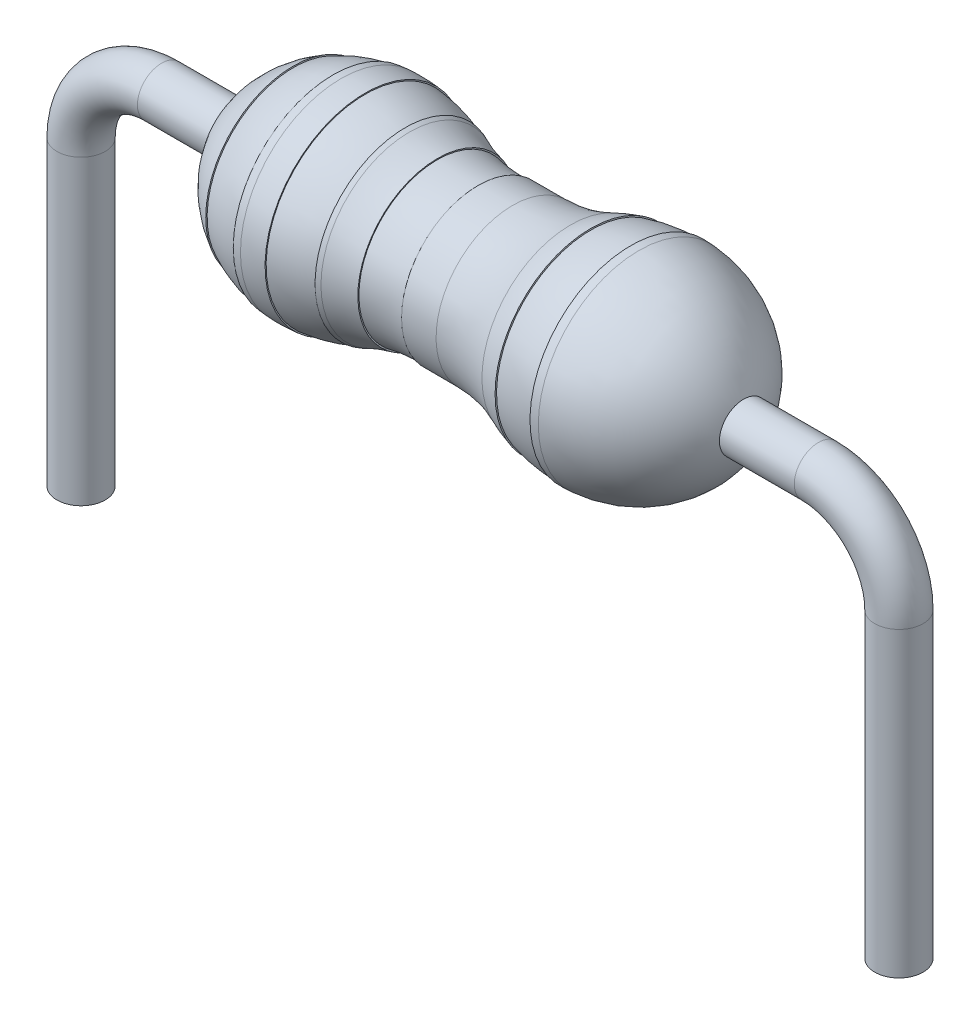
ISO-10303-21;
HEADER;
FILE_DESCRIPTION(('STEP AP214'),'2;1');
FILE_NAME('part.step','',(''),(''),'','','');
FILE_SCHEMA(('AUTOMOTIVE_DESIGN { 1 0 10303 214 1 1 1 1 }'));
ENDSEC;
DATA;
#1=APPLICATION_CONTEXT('core data for automotive mechanical design processes');
#2=APPLICATION_PROTOCOL_DEFINITION('international standard','automotive_design',2000,#1);
#3=PRODUCT_CONTEXT('',#1,'mechanical');
#4=PRODUCT('Part','Part','',(#3));
#5=PRODUCT_RELATED_PRODUCT_CATEGORY('part','',(#4));
#6=PRODUCT_DEFINITION_FORMATION('','',#4);
#7=PRODUCT_DEFINITION_CONTEXT('part definition',#1,'design');
#8=PRODUCT_DEFINITION('design','',#6,#7);
#9=PRODUCT_DEFINITION_SHAPE('','',#8);
#10=(LENGTH_UNIT() NAMED_UNIT(*) SI_UNIT(.MILLI.,.METRE.));
#11=(NAMED_UNIT(*) PLANE_ANGLE_UNIT() SI_UNIT($,.RADIAN.));
#12=(NAMED_UNIT(*) SI_UNIT($,.STERADIAN.) SOLID_ANGLE_UNIT());
#13=UNCERTAINTY_MEASURE_WITH_UNIT(LENGTH_MEASURE(1.E-05),#10,'distance_accuracy_value','');
#14=(GEOMETRIC_REPRESENTATION_CONTEXT(3) GLOBAL_UNCERTAINTY_ASSIGNED_CONTEXT((#13)) GLOBAL_UNIT_ASSIGNED_CONTEXT((#10,
#11,#12)) REPRESENTATION_CONTEXT('',''));
#15=CARTESIAN_POINT('',(0.,0.,0.));
#16=DIRECTION('',(0.,0.,1.));
#17=DIRECTION('',(1.,0.,0.));
#18=AXIS2_PLACEMENT_3D('',#15,#16,#17);
#19=CARTESIAN_POINT('',(4.88671199011125,0.,0.));
#20=DIRECTION('',(-1.,0.,0.));
#21=DIRECTION('',(0.,1.,0.));
#22=AXIS2_PLACEMENT_3D('',#19,#20,#21);
#23=DEGENERATE_TOROIDAL_SURFACE('',#22,0.59136794396373,1.84484960857024,.F.);
#24=CARTESIAN_POINT('',(5.,0.,0.));
#25=DIRECTION('',(1.,0.,0.));
#26=DIRECTION('',(0.,1.,0.));
#27=AXIS2_PLACEMENT_3D('',#24,#25,#26);
#28=CIRCLE('',#27,1.25);
#29=CARTESIAN_POINT('',(5.,1.25,0.));
#30=VERTEX_POINT('',#29);
#31=EDGE_CURVE('E94',#30,#30,#28,.T.);
#32=ORIENTED_EDGE('',*,*,#31,.F.);
#33=EDGE_LOOP('',(#32));
#34=FACE_BOUND('',#33,.T.);
#35=CARTESIAN_POINT('',(4.89996300624203,0.,0.));
#36=DIRECTION('',(-1.,0.,0.));
#37=DIRECTION('',(0.,-1.,0.));
#38=AXIS2_PLACEMENT_3D('',#35,#36,#37);
#39=CIRCLE('',#38,1.2534340749026);
#40=CARTESIAN_POINT('',(4.89996300624203,-1.2534340749026,0.));
#41=VERTEX_POINT('',#40);
#42=EDGE_CURVE('E123',#41,#41,#39,.F.);
#43=ORIENTED_EDGE('',*,*,#42,.T.);
#44=EDGE_LOOP('',(#43));
#45=FACE_BOUND('',#44,.T.);
#46=ADVANCED_FACE('F52',(#34,#45),#23,.F.);
#47=CARTESIAN_POINT('',(4.90833503188563,0.,0.));
#48=DIRECTION('',(-1.,0.,0.));
#49=DIRECTION('',(0.,1.,0.));
#50=AXIS2_PLACEMENT_3D('',#47,#48,#49);
#51=DEGENERATE_TOROIDAL_SURFACE('',#50,0.239909956367037,1.49272708304667,.F.);
#52=CARTESIAN_POINT('',(6.3,0.,0.));
#53=DIRECTION('',(1.,0.,0.));
#54=DIRECTION('',(0.,1.,0.));
#55=AXIS2_PLACEMENT_3D('',#52,#53,#54);
#56=CIRCLE('',#55,0.3);
#57=CARTESIAN_POINT('',(6.3,0.3,0.));
#58=VERTEX_POINT('',#57);
#59=EDGE_CURVE('E99',#58,#58,#56,.T.);
#60=ORIENTED_EDGE('',*,*,#59,.F.);
#61=EDGE_LOOP('',(#60));
#62=FACE_BOUND('',#61,.T.);
#63=ORIENTED_EDGE('',*,*,#31,.T.);
#64=EDGE_LOOP('',(#63));
#65=FACE_BOUND('',#64,.T.);
#66=ADVANCED_FACE('F202',(#62,#65),#51,.F.);
#67=CARTESIAN_POINT('',(8.23,-4.75,0.));
#68=DIRECTION('',(0.,1.,0.));
#69=DIRECTION('',(1.,0.,0.));
#70=AXIS2_PLACEMENT_3D('',#67,#68,#69);
#71=PLANE('',#70);
#72=CARTESIAN_POINT('',(8.23,-4.75,0.));
#73=DIRECTION('',(0.,-1.,0.));
#74=DIRECTION('',(1.,0.,0.));
#75=AXIS2_PLACEMENT_3D('',#72,#73,#74);
#76=CIRCLE('',#75,0.3);
#77=CARTESIAN_POINT('',(8.53,-4.75,0.));
#78=VERTEX_POINT('',#77);
#79=EDGE_CURVE('E72',#78,#78,#76,.T.);
#80=ORIENTED_EDGE('',*,*,#79,.T.);
#81=EDGE_LOOP('',(#80));
#82=FACE_BOUND('',#81,.T.);
#83=ADVANCED_FACE('F73',(#82),#71,.F.);
#84=CARTESIAN_POINT('',(6.3,0.,0.));
#85=DIRECTION('',(1.,0.,0.));
#86=DIRECTION('',(0.,-1.,0.));
#87=AXIS2_PLACEMENT_3D('',#84,#85,#86);
#88=CYLINDRICAL_SURFACE('',#87,0.3);
#89=CARTESIAN_POINT('',(7.23,0.,0.));
#90=DIRECTION('',(1.,0.,0.));
#91=DIRECTION('',(0.,1.,0.));
#92=AXIS2_PLACEMENT_3D('',#89,#90,#91);
#93=CIRCLE('',#92,0.3);
#94=CARTESIAN_POINT('',(7.23,0.3,0.));
#95=VERTEX_POINT('',#94);
#96=EDGE_CURVE('E87',#95,#95,#93,.T.);
#97=ORIENTED_EDGE('',*,*,#96,.F.);
#98=EDGE_LOOP('',(#97));
#99=FACE_BOUND('',#98,.T.);
#100=ORIENTED_EDGE('',*,*,#59,.T.);
#101=EDGE_LOOP('',(#100));
#102=FACE_BOUND('',#101,.T.);
#103=ADVANCED_FACE('F196',(#99,#102),#88,.T.);
#104=CARTESIAN_POINT('',(7.23,-1.,0.));
#105=DIRECTION('',(0.,0.,1.));
#106=DIRECTION('',(-1.,0.,0.));
#107=AXIS2_PLACEMENT_3D('',#104,#105,#106);
#108=TOROIDAL_SURFACE('',#107,1.,0.3);
#109=CARTESIAN_POINT('',(8.23,-1.,0.));
#110=DIRECTION('',(0.,-1.,0.));
#111=DIRECTION('',(1.,0.,0.));
#112=AXIS2_PLACEMENT_3D('',#109,#110,#111);
#113=CIRCLE('',#112,0.3);
#114=CARTESIAN_POINT('',(8.53,-1.,0.));
#115=VERTEX_POINT('',#114);
#116=EDGE_CURVE('E77',#115,#115,#113,.T.);
#117=CARTESIAN_POINT('',(7.23,-1.,0.));
#118=DIRECTION('',(0.,0.,1.));
#119=DIRECTION('',(-1.,0.,0.));
#120=AXIS2_PLACEMENT_3D('',#117,#118,#119);
#121=CIRCLE('',#120,1.3);
#122=EDGE_CURVE('',#115,#95,#121,.T.);
#123=ORIENTED_EDGE('',*,*,#116,.F.);
#124=ORIENTED_EDGE('',*,*,#96,.T.);
#125=ORIENTED_EDGE('',*,*,#122,.T.);
#126=ORIENTED_EDGE('',*,*,#122,.F.);
#127=EDGE_LOOP('',(#123,#125,#124,#126));
#128=FACE_BOUND('',#127,.T.);
#129=ADVANCED_FACE('F194',(#128),#108,.T.);
#130=CARTESIAN_POINT('',(8.23,-1.,0.));
#131=DIRECTION('',(0.,-1.,0.));
#132=DIRECTION('',(-1.,0.,0.));
#133=AXIS2_PLACEMENT_3D('',#130,#131,#132);
#134=CYLINDRICAL_SURFACE('',#133,0.3);
#135=ORIENTED_EDGE('',*,*,#79,.F.);
#136=EDGE_LOOP('',(#135));
#137=FACE_BOUND('',#136,.T.);
#138=ORIENTED_EDGE('',*,*,#116,.T.);
#139=EDGE_LOOP('',(#138));
#140=FACE_BOUND('',#139,.T.);
#141=ADVANCED_FACE('F218',(#137,#140),#134,.T.);
#142=CARTESIAN_POINT('',(4.89985634583904,0.,0.));
#143=DIRECTION('',(1.,0.,0.));
#144=DIRECTION('',(0.,1.,0.));
#145=AXIS2_PLACEMENT_3D('',#142,#143,#144);
#146=CONICAL_SURFACE('',#145,1.23858484939256,1.56361355698464);
#147=ORIENTED_EDGE('',*,*,#42,.F.);
#148=EDGE_LOOP('',(#147));
#149=FACE_BOUND('',#148,.T.);
#150=CARTESIAN_POINT('',(4.89985634583904,0.,0.));
#151=DIRECTION('',(-1.,0.,0.));
#152=DIRECTION('',(0.,-1.,0.));
#153=AXIS2_PLACEMENT_3D('',#150,#151,#152);
#154=CIRCLE('',#153,1.23858484939256);
#155=CARTESIAN_POINT('',(4.89985634583904,-1.23858484939256,0.));
#156=VERTEX_POINT('',#155);
#157=EDGE_CURVE('E181',#156,#156,#154,.T.);
#158=ORIENTED_EDGE('',*,*,#157,.F.);
#159=EDGE_LOOP('',(#158));
#160=FACE_BOUND('',#159,.T.);
#161=ADVANCED_FACE('F214',(#149,#160),#146,.T.);
#162=CARTESIAN_POINT('',(4.88671199011125,0.,0.));
#163=DIRECTION('',(-1.,0.,0.));
#164=DIRECTION('',(0.,-1.,0.));
#165=AXIS2_PLACEMENT_3D('',#162,#163,#164);
#166=DEGENERATE_TOROIDAL_SURFACE('',#165,0.59136794396373,1.83,.F.);
#167=ORIENTED_EDGE('',*,*,#157,.T.);
#168=EDGE_LOOP('',(#167));
#169=FACE_BOUND('',#168,.T.);
#170=CARTESIAN_POINT('',(4.40526175124444,0.,0.));
#171=DIRECTION('',(-1.,0.,0.));
#172=DIRECTION('',(0.,-1.,0.));
#173=AXIS2_PLACEMENT_3D('',#170,#171,#172);
#174=CIRCLE('',#173,1.17416474264819);
#175=CARTESIAN_POINT('',(4.40526175124444,-1.17416474264819,0.));
#176=VERTEX_POINT('',#175);
#177=EDGE_CURVE('E185',#176,#176,#174,.T.);
#178=ORIENTED_EDGE('',*,*,#177,.F.);
#179=EDGE_LOOP('',(#178));
#180=FACE_BOUND('',#179,.T.);
#181=ADVANCED_FACE('F217',(#169,#180),#166,.F.);
#182=CARTESIAN_POINT('',(4.4,0.,0.));
#183=DIRECTION('',(-1.,0.,0.));
#184=DIRECTION('',(0.,-1.,0.));
#185=AXIS2_PLACEMENT_3D('',#182,#183,#184);
#186=CONICAL_SURFACE('',#185,1.19346018184613,1.30457521106342);
#187=CARTESIAN_POINT('',(4.40135500392574,0.,0.));
#188=DIRECTION('',(1.,0.,0.));
#189=DIRECTION('',(0.,1.,0.));
#190=AXIS2_PLACEMENT_3D('',#187,#188,#189);
#191=CIRCLE('',#190,1.18849122861221);
#192=CARTESIAN_POINT('',(4.40135500392574,1.18849122861221,0.));
#193=VERTEX_POINT('',#192);
#194=EDGE_CURVE('E119',#193,#193,#191,.F.);
#195=ORIENTED_EDGE('',*,*,#194,.F.);
#196=EDGE_LOOP('',(#195));
#197=FACE_BOUND('',#196,.T.);
#198=ORIENTED_EDGE('',*,*,#177,.T.);
#199=EDGE_LOOP('',(#198));
#200=FACE_BOUND('',#199,.T.);
#201=ADVANCED_FACE('F224',(#197,#200),#186,.T.);
#202=CARTESIAN_POINT('',(3.15,0.,0.));
#203=DIRECTION('',(1.,0.,0.));
#204=DIRECTION('',(0.,1.,0.));
#205=AXIS2_PLACEMENT_3D('',#202,#203,#204);
#206=CYLINDRICAL_SURFACE('',#205,0.95);
#207=CARTESIAN_POINT('',(3.43,0.,0.));
#208=DIRECTION('',(1.,0.,0.));
#209=DIRECTION('',(0.,1.,0.));
#210=AXIS2_PLACEMENT_3D('',#207,#208,#209);
#211=CIRCLE('',#210,0.95);
#212=CARTESIAN_POINT('',(3.43,0.95,0.));
#213=VERTEX_POINT('',#212);
#214=EDGE_CURVE('E76',#213,#213,#211,.T.);
#215=ORIENTED_EDGE('',*,*,#214,.F.);
#216=EDGE_LOOP('',(#215));
#217=FACE_BOUND('',#216,.T.);
#218=CARTESIAN_POINT('',(3.00129083809589,0.,0.));
#219=DIRECTION('',(-1.,0.,0.));
#220=DIRECTION('',(0.,-1.,0.));
#221=AXIS2_PLACEMENT_3D('',#218,#219,#220);
#222=CIRCLE('',#221,0.95);
#223=CARTESIAN_POINT('',(3.00129083809589,-0.95,0.));
#224=VERTEX_POINT('',#223);
#225=EDGE_CURVE('E128',#224,#224,#222,.F.);
#226=ORIENTED_EDGE('',*,*,#225,.T.);
#227=EDGE_LOOP('',(#226));
#228=FACE_BOUND('',#227,.T.);
#229=ADVANCED_FACE('F229',(#217,#228),#206,.T.);
#230=CARTESIAN_POINT('',(3.43,0.,0.));
#231=DIRECTION('',(-1.,0.,0.));
#232=DIRECTION('',(0.,1.,0.));
#233=AXIS2_PLACEMENT_3D('',#230,#231,#232);
#234=TOROIDAL_SURFACE('',#233,2.75300000000001,1.80300000000001);
#235=CARTESIAN_POINT('',(4.15,0.,0.));
#236=DIRECTION('',(1.,0.,0.));
#237=DIRECTION('',(0.,1.,0.));
#238=AXIS2_PLACEMENT_3D('',#235,#236,#237);
#239=CIRCLE('',#238,1.1);
#240=CARTESIAN_POINT('',(4.15,1.1,0.));
#241=VERTEX_POINT('',#240);
#242=EDGE_CURVE('E83',#241,#241,#239,.T.);
#243=ORIENTED_EDGE('',*,*,#242,.F.);
#244=EDGE_LOOP('',(#243));
#245=FACE_BOUND('',#244,.T.);
#246=ORIENTED_EDGE('',*,*,#214,.T.);
#247=EDGE_LOOP('',(#246));
#248=FACE_BOUND('',#247,.T.);
#249=ADVANCED_FACE('F235',(#245,#248),#234,.F.);
#250=ORIENTED_EDGE('',*,*,#242,.T.);
#251=EDGE_LOOP('',(#250));
#252=FACE_BOUND('',#251,.T.);
#253=ORIENTED_EDGE('',*,*,#194,.T.);
#254=EDGE_LOOP('',(#253));
#255=FACE_BOUND('',#254,.T.);
#256=ADVANCED_FACE('F211',(#252,#255),#23,.F.);
#257=CARTESIAN_POINT('',(3.00217877094972,0.,0.));
#258=DIRECTION('',(-1.,0.,0.));
#259=DIRECTION('',(0.,-1.,0.));
#260=AXIS2_PLACEMENT_3D('',#257,#258,#259);
#261=CONICAL_SURFACE('',#260,0.937806133629193,1.49810663251364);
#262=ORIENTED_EDGE('',*,*,#225,.F.);
#263=EDGE_LOOP('',(#262));
#264=FACE_BOUND('',#263,.T.);
#265=CARTESIAN_POINT('',(3.00217877094972,0.,0.));
#266=DIRECTION('',(-1.,0.,0.));
#267=DIRECTION('',(0.,-1.,0.));
#268=AXIS2_PLACEMENT_3D('',#265,#266,#267);
#269=CIRCLE('',#268,0.937806133629193);
#270=CARTESIAN_POINT('',(3.00217877094972,-0.937806133629193,0.));
#271=VERTEX_POINT('',#270);
#272=EDGE_CURVE('E174',#271,#271,#269,.T.);
#273=ORIENTED_EDGE('',*,*,#272,.F.);
#274=EDGE_LOOP('',(#273));
#275=FACE_BOUND('',#274,.T.);
#276=ADVANCED_FACE('F240',(#264,#275),#261,.F.);
#277=CARTESIAN_POINT('',(2.87,0.,0.));
#278=DIRECTION('',(-1.,0.,0.));
#279=DIRECTION('',(0.,-1.,0.));
#280=AXIS2_PLACEMENT_3D('',#277,#278,#279);
#281=TOROIDAL_SURFACE('',#280,2.75300000000001,1.82);
#282=ORIENTED_EDGE('',*,*,#272,.T.);
#283=EDGE_LOOP('',(#282));
#284=FACE_BOUND('',#283,.T.);
#285=CARTESIAN_POINT('',(2.49379888268156,0.,0.));
#286=DIRECTION('',(-1.,0.,0.));
#287=DIRECTION('',(0.,-1.,0.));
#288=AXIS2_PLACEMENT_3D('',#285,#286,#287);
#289=CIRCLE('',#288,0.972305551384983);
#290=CARTESIAN_POINT('',(2.49379888268156,-0.972305551384983,0.));
#291=VERTEX_POINT('',#290);
#292=EDGE_CURVE('E177',#291,#291,#289,.T.);
#293=ORIENTED_EDGE('',*,*,#292,.F.);
#294=EDGE_LOOP('',(#293));
#295=FACE_BOUND('',#294,.T.);
#296=ADVANCED_FACE('F312',(#284,#295),#281,.F.);
#297=CARTESIAN_POINT('',(2.5,0.,0.));
#298=DIRECTION('',(1.,0.,0.));
#299=DIRECTION('',(0.,1.,0.));
#300=AXIS2_PLACEMENT_3D('',#297,#298,#299);
#301=CONICAL_SURFACE('',#300,1.00165765768084,1.36259141760708);
#302=CARTESIAN_POINT('',(2.49731284916201,0.,0.));
#303=DIRECTION('',(1.,0.,0.));
#304=DIRECTION('',(0.,1.,0.));
#305=AXIS2_PLACEMENT_3D('',#302,#303,#304);
#306=CIRCLE('',#305,0.988938411619294);
#307=CARTESIAN_POINT('',(2.49731284916201,0.988938411619294,0.));
#308=VERTEX_POINT('',#307);
#309=EDGE_CURVE('E132',#308,#308,#306,.F.);
#310=ORIENTED_EDGE('',*,*,#309,.F.);
#311=EDGE_LOOP('',(#310));
#312=FACE_BOUND('',#311,.T.);
#313=ORIENTED_EDGE('',*,*,#292,.T.);
#314=EDGE_LOOP('',(#313));
#315=FACE_BOUND('',#314,.T.);
#316=ADVANCED_FACE('F272',(#312,#315),#301,.F.);
#317=CARTESIAN_POINT('',(2.87,0.,0.));
#318=DIRECTION('',(1.,0.,0.));
#319=DIRECTION('',(0.,1.,0.));
#320=AXIS2_PLACEMENT_3D('',#317,#318,#319);
#321=TOROIDAL_SURFACE('',#320,2.75300000000001,1.80300000000001);
#322=CARTESIAN_POINT('',(2.15,0.,0.));
#323=DIRECTION('',(1.,0.,0.));
#324=DIRECTION('',(0.,1.,0.));
#325=AXIS2_PLACEMENT_3D('',#322,#323,#324);
#326=CIRCLE('',#325,1.1);
#327=CARTESIAN_POINT('',(2.15,1.1,0.));
#328=VERTEX_POINT('',#327);
#329=EDGE_CURVE('E62',#328,#328,#326,.T.);
#330=ORIENTED_EDGE('',*,*,#329,.T.);
#331=EDGE_LOOP('',(#330));
#332=FACE_BOUND('',#331,.T.);
#333=ORIENTED_EDGE('',*,*,#309,.T.);
#334=EDGE_LOOP('',(#333));
#335=FACE_BOUND('',#334,.T.);
#336=ADVANCED_FACE('F269',(#332,#335),#321,.F.);
#337=CARTESIAN_POINT('',(1.41328800988875,0.,0.));
#338=DIRECTION('',(1.,0.,0.));
#339=DIRECTION('',(0.,1.,0.));
#340=AXIS2_PLACEMENT_3D('',#337,#338,#339);
#341=DEGENERATE_TOROIDAL_SURFACE('',#340,0.59136794396373,1.84484960857024,.F.);
#342=ORIENTED_EDGE('',*,*,#329,.F.);
#343=EDGE_LOOP('',(#342));
#344=FACE_BOUND('',#343,.T.);
#345=CARTESIAN_POINT('',(2.09808819700077,0.,0.));
#346=DIRECTION('',(-1.,0.,0.));
#347=DIRECTION('',(0.,-1.,0.));
#348=AXIS2_PLACEMENT_3D('',#345,#346,#347);
#349=CIRCLE('',#348,1.12167577467661);
#350=CARTESIAN_POINT('',(2.09808819700077,-1.12167577467661,0.));
#351=VERTEX_POINT('',#350);
#352=EDGE_CURVE('E136',#351,#351,#349,.F.);
#353=ORIENTED_EDGE('',*,*,#352,.T.);
#354=EDGE_LOOP('',(#353));
#355=FACE_BOUND('',#354,.T.);
#356=ADVANCED_FACE('F271',(#344,#355),#341,.F.);
#357=CARTESIAN_POINT('',(1.41328800988875,0.,0.));
#358=DIRECTION('',(-1.,0.,0.));
#359=DIRECTION('',(0.,-1.,0.));
#360=AXIS2_PLACEMENT_3D('',#357,#358,#359);
#361=DEGENERATE_TOROIDAL_SURFACE('',#360,0.59136794396373,1.83,.F.);
#362=CARTESIAN_POINT('',(2.09257608659339,0.,0.));
#363=DIRECTION('',(-1.,0.,0.));
#364=DIRECTION('',(0.,-1.,0.));
#365=AXIS2_PLACEMENT_3D('',#362,#363,#364);
#366=CIRCLE('',#365,1.10788710129784);
#367=CARTESIAN_POINT('',(2.09257608659339,-1.10788710129784,0.));
#368=VERTEX_POINT('',#367);
#369=EDGE_CURVE('E171',#368,#368,#366,.T.);
#370=ORIENTED_EDGE('',*,*,#369,.T.);
#371=EDGE_LOOP('',(#370));
#372=FACE_BOUND('',#371,.T.);
#373=CARTESIAN_POINT('',(1.5979814919988,0.,0.));
#374=DIRECTION('',(-1.,0.,0.));
#375=DIRECTION('',(0.,-1.,0.));
#376=AXIS2_PLACEMENT_3D('',#373,#374,#375);
#377=CIRCLE('',#376,1.22928806903435);
#378=CARTESIAN_POINT('',(1.5979814919988,-1.22928806903435,0.));
#379=VERTEX_POINT('',#378);
#380=EDGE_CURVE('E168',#379,#379,#377,.T.);
#381=ORIENTED_EDGE('',*,*,#380,.F.);
#382=EDGE_LOOP('',(#381));
#383=FACE_BOUND('',#382,.T.);
#384=ADVANCED_FACE('F288',(#372,#383),#361,.F.);
#385=CARTESIAN_POINT('',(1.6,0.,0.));
#386=DIRECTION('',(1.,0.,0.));
#387=DIRECTION('',(0.,1.,0.));
#388=AXIS2_PLACEMENT_3D('',#385,#386,#387);
#389=CONICAL_SURFACE('',#388,1.24918594895783,1.46969879997184);
#390=CARTESIAN_POINT('',(1.59948019468448,0.,0.));
#391=DIRECTION('',(-1.,0.,0.));
#392=DIRECTION('',(0.,-1.,0.));
#393=AXIS2_PLACEMENT_3D('',#390,#391,#392);
#394=CIRCLE('',#393,1.24406185544641);
#395=CARTESIAN_POINT('',(1.59948019468448,-1.24406185544641,0.));
#396=VERTEX_POINT('',#395);
#397=EDGE_CURVE('E140',#396,#396,#394,.T.);
#398=ORIENTED_EDGE('',*,*,#397,.F.);
#399=EDGE_LOOP('',(#398));
#400=FACE_BOUND('',#399,.T.);
#401=ORIENTED_EDGE('',*,*,#380,.T.);
#402=EDGE_LOOP('',(#401));
#403=FACE_BOUND('',#402,.T.);
#404=ADVANCED_FACE('F283',(#400,#403),#389,.F.);
#405=CARTESIAN_POINT('',(2.09257608659339,0.,0.));
#406=DIRECTION('',(1.,0.,0.));
#407=DIRECTION('',(0.,1.,0.));
#408=AXIS2_PLACEMENT_3D('',#405,#406,#407);
#409=CONICAL_SURFACE('',#408,1.10788710129784,1.19049996877768);
#410=ORIENTED_EDGE('',*,*,#352,.F.);
#411=EDGE_LOOP('',(#410));
#412=FACE_BOUND('',#411,.T.);
#413=ORIENTED_EDGE('',*,*,#369,.F.);
#414=EDGE_LOOP('',(#413));
#415=FACE_BOUND('',#414,.T.);
#416=ADVANCED_FACE('F276',(#412,#415),#409,.T.);
#417=CARTESIAN_POINT('',(1.3,0.,0.));
#418=DIRECTION('',(1.,0.,0.));
#419=DIRECTION('',(0.,1.,0.));
#420=AXIS2_PLACEMENT_3D('',#417,#418,#419);
#421=CIRCLE('',#420,1.25);
#422=CARTESIAN_POINT('',(1.3,1.25,0.));
#423=VERTEX_POINT('',#422);
#424=EDGE_CURVE('E12',#423,#423,#421,.T.);
#425=ORIENTED_EDGE('',*,*,#424,.T.);
#426=EDGE_LOOP('',(#425));
#427=FACE_BOUND('',#426,.T.);
#428=ORIENTED_EDGE('',*,*,#397,.T.);
#429=EDGE_LOOP('',(#428));
#430=FACE_BOUND('',#429,.T.);
#431=ADVANCED_FACE('F274',(#427,#430),#341,.F.);
#432=CARTESIAN_POINT('',(1.39166496811437,0.,0.));
#433=DIRECTION('',(1.,0.,0.));
#434=DIRECTION('',(0.,1.,0.));
#435=AXIS2_PLACEMENT_3D('',#432,#433,#434);
#436=DEGENERATE_TOROIDAL_SURFACE('',#435,0.239909956367037,1.49272708304667,.F.);
#437=ORIENTED_EDGE('',*,*,#424,.F.);
#438=EDGE_LOOP('',(#437));
#439=FACE_BOUND('',#438,.T.);
#440=CARTESIAN_POINT('',(1.20092930893064,0.,0.));
#441=DIRECTION('',(1.,0.,0.));
#442=DIRECTION('',(0.,1.,0.));
#443=AXIS2_PLACEMENT_3D('',#440,#441,#442);
#444=CIRCLE('',#443,1.24058119618227);
#445=CARTESIAN_POINT('',(1.20092930893064,1.24058119618227,0.));
#446=VERTEX_POINT('',#445);
#447=EDGE_CURVE('E56',#446,#446,#444,.T.);
#448=ORIENTED_EDGE('',*,*,#447,.T.);
#449=EDGE_LOOP('',(#448));
#450=FACE_BOUND('',#449,.T.);
#451=ADVANCED_FACE('F54',(#439,#450),#436,.F.);
#452=CARTESIAN_POINT('',(1.39166496811437,0.,0.));
#453=DIRECTION('',(-1.,0.,0.));
#454=DIRECTION('',(0.,-1.,0.));
#455=AXIS2_PLACEMENT_3D('',#452,#453,#454);
#456=DEGENERATE_TOROIDAL_SURFACE('',#455,0.239909956367037,1.48,.F.);
#457=CARTESIAN_POINT('',(1.20255553290819,0.,0.));
#458=DIRECTION('',(-1.,0.,0.));
#459=DIRECTION('',(0.,-1.,0.));
#460=AXIS2_PLACEMENT_3D('',#457,#458,#459);
#461=CIRCLE('',#460,1.22795843743263);
#462=CARTESIAN_POINT('',(1.20255553290819,-1.22795843743263,0.));
#463=VERTEX_POINT('',#462);
#464=EDGE_CURVE('E124',#463,#463,#461,.T.);
#465=ORIENTED_EDGE('',*,*,#464,.T.);
#466=EDGE_LOOP('',(#465));
#467=FACE_BOUND('',#466,.T.);
#468=CARTESIAN_POINT('',(0.709222199574858,0.,0.));
#469=DIRECTION('',(-1.,0.,0.));
#470=DIRECTION('',(0.,-1.,0.));
#471=AXIS2_PLACEMENT_3D('',#468,#469,#470);
#472=CIRCLE('',#471,1.07335767350439);
#473=CARTESIAN_POINT('',(0.709222199574858,-1.07335767350439,0.));
#474=VERTEX_POINT('',#473);
#475=EDGE_CURVE('E163',#474,#474,#472,.T.);
#476=ORIENTED_EDGE('',*,*,#475,.F.);
#477=EDGE_LOOP('',(#476));
#478=FACE_BOUND('',#477,.T.);
#479=ADVANCED_FACE('F157',(#467,#478),#456,.F.);
#480=CARTESIAN_POINT('',(1.20255553290819,0.,0.));
#481=DIRECTION('',(-1.,0.,0.));
#482=DIRECTION('',(0.,-1.,0.));
#483=AXIS2_PLACEMENT_3D('',#480,#481,#482);
#484=CONICAL_SURFACE('',#483,1.22795843743263,1.44266940290122);
#485=ORIENTED_EDGE('',*,*,#447,.F.);
#486=EDGE_LOOP('',(#485));
#487=FACE_BOUND('',#486,.T.);
#488=ORIENTED_EDGE('',*,*,#464,.F.);
#489=EDGE_LOOP('',(#488));
#490=FACE_BOUND('',#489,.T.);
#491=ADVANCED_FACE('F153',(#487,#490),#484,.F.);
#492=CARTESIAN_POINT('',(0.7,0.,0.));
#493=DIRECTION('',(-1.,0.,0.));
#494=DIRECTION('',(0.,-1.,0.));
#495=AXIS2_PLACEMENT_3D('',#492,#493,#494);
#496=CONICAL_SURFACE('',#495,1.09110453336752,1.09155063268086);
#497=CARTESIAN_POINT('',(0.703353614581747,0.,0.));
#498=DIRECTION('',(1.,0.,0.));
#499=DIRECTION('',(0.,1.,0.));
#500=AXIS2_PLACEMENT_3D('',#497,#498,#499);
#501=CIRCLE('',#500,1.08465096146918);
#502=CARTESIAN_POINT('',(0.703353614581747,1.08465096146918,0.));
#503=VERTEX_POINT('',#502);
#504=EDGE_CURVE('E143',#503,#503,#501,.F.);
#505=ORIENTED_EDGE('',*,*,#504,.F.);
#506=EDGE_LOOP('',(#505));
#507=FACE_BOUND('',#506,.T.);
#508=ORIENTED_EDGE('',*,*,#475,.T.);
#509=EDGE_LOOP('',(#508));
#510=FACE_BOUND('',#509,.T.);
#511=ADVANCED_FACE('F156',(#507,#510),#496,.T.);
#512=CARTESIAN_POINT('',(-1.93,-4.75,0.));
#513=DIRECTION('',(0.,1.,0.));
#514=DIRECTION('',(-1.,0.,0.));
#515=AXIS2_PLACEMENT_3D('',#512,#513,#514);
#516=PLANE('',#515);
#517=CARTESIAN_POINT('',(-1.93,-4.75,0.));
#518=DIRECTION('',(0.,1.,0.));
#519=DIRECTION('',(-1.,0.,0.));
#520=AXIS2_PLACEMENT_3D('',#517,#518,#519);
#521=CIRCLE('',#520,0.3);
#522=CARTESIAN_POINT('',(-2.23,-4.75,0.));
#523=VERTEX_POINT('',#522);
#524=EDGE_CURVE('E68',#523,#523,#521,.T.);
#525=ORIENTED_EDGE('',*,*,#524,.F.);
#526=EDGE_LOOP('',(#525));
#527=FACE_BOUND('',#526,.T.);
#528=ADVANCED_FACE('F265',(#527),#516,.F.);
#529=CARTESIAN_POINT('',(-1.93,-1.,0.));
#530=DIRECTION('',(0.,-1.,0.));
#531=DIRECTION('',(1.,0.,0.));
#532=AXIS2_PLACEMENT_3D('',#529,#530,#531);
#533=CYLINDRICAL_SURFACE('',#532,0.3);
#534=ORIENTED_EDGE('',*,*,#524,.T.);
#535=EDGE_LOOP('',(#534));
#536=FACE_BOUND('',#535,.T.);
#537=CARTESIAN_POINT('',(-1.93,-1.,0.));
#538=DIRECTION('',(0.,1.,0.));
#539=DIRECTION('',(-1.,0.,0.));
#540=AXIS2_PLACEMENT_3D('',#537,#538,#539);
#541=CIRCLE('',#540,0.3);
#542=CARTESIAN_POINT('',(-2.23,-1.,0.));
#543=VERTEX_POINT('',#542);
#544=EDGE_CURVE('E107',#543,#543,#541,.T.);
#545=ORIENTED_EDGE('',*,*,#544,.F.);
#546=EDGE_LOOP('',(#545));
#547=FACE_BOUND('',#546,.T.);
#548=ADVANCED_FACE('F261',(#536,#547),#533,.T.);
#549=CARTESIAN_POINT('',(-0.93,-1.,0.));
#550=DIRECTION('',(0.,0.,1.));
#551=DIRECTION('',(1.,0.,0.));
#552=AXIS2_PLACEMENT_3D('',#549,#550,#551);
#553=TOROIDAL_SURFACE('',#552,1.,0.3);
#554=CARTESIAN_POINT('',(-0.93,0.,0.));
#555=DIRECTION('',(1.,0.,0.));
#556=DIRECTION('',(0.,1.,0.));
#557=AXIS2_PLACEMENT_3D('',#554,#555,#556);
#558=CIRCLE('',#557,0.3);
#559=CARTESIAN_POINT('',(-0.93,0.3,0.));
#560=VERTEX_POINT('',#559);
#561=EDGE_CURVE('E103',#560,#560,#558,.T.);
#562=CARTESIAN_POINT('',(-0.93,-1.,0.));
#563=DIRECTION('',(0.,0.,1.));
#564=DIRECTION('',(1.,0.,0.));
#565=AXIS2_PLACEMENT_3D('',#562,#563,#564);
#566=CIRCLE('',#565,1.3);
#567=EDGE_CURVE('',#560,#543,#566,.T.);
#568=ORIENTED_EDGE('',*,*,#561,.F.);
#569=ORIENTED_EDGE('',*,*,#544,.T.);
#570=ORIENTED_EDGE('',*,*,#567,.T.);
#571=ORIENTED_EDGE('',*,*,#567,.F.);
#572=EDGE_LOOP('',(#568,#570,#569,#571));
#573=FACE_BOUND('',#572,.T.);
#574=ADVANCED_FACE('F257',(#573),#553,.T.);
#575=CARTESIAN_POINT('',(0.,0.,0.));
#576=DIRECTION('',(-1.,0.,0.));
#577=DIRECTION('',(0.,-1.,0.));
#578=AXIS2_PLACEMENT_3D('',#575,#576,#577);
#579=CYLINDRICAL_SURFACE('',#578,0.3);
#580=ORIENTED_EDGE('',*,*,#561,.T.);
#581=EDGE_LOOP('',(#580));
#582=FACE_BOUND('',#581,.T.);
#583=CARTESIAN_POINT('',(0.,0.,0.));
#584=DIRECTION('',(1.,0.,0.));
#585=DIRECTION('',(0.,1.,0.));
#586=AXIS2_PLACEMENT_3D('',#583,#584,#585);
#587=CIRCLE('',#586,0.3);
#588=CARTESIAN_POINT('',(0.,0.3,0.));
#589=VERTEX_POINT('',#588);
#590=EDGE_CURVE('E98',#589,#589,#587,.T.);
#591=ORIENTED_EDGE('',*,*,#590,.F.);
#592=EDGE_LOOP('',(#591));
#593=FACE_BOUND('',#592,.T.);
#594=ADVANCED_FACE('F253',(#582,#593),#579,.T.);
#595=ORIENTED_EDGE('',*,*,#590,.T.);
#596=EDGE_LOOP('',(#595));
#597=FACE_BOUND('',#596,.T.);
#598=ORIENTED_EDGE('',*,*,#504,.T.);
#599=EDGE_LOOP('',(#598));
#600=FACE_BOUND('',#599,.T.);
#601=ADVANCED_FACE('F256',(#597,#600),#436,.F.);
#602=CLOSED_SHELL('',(#46,#66,#83,#103,#129,#141,#161,#181,#201,#229,#249,#256,#276,#296,#316,
#336,#356,#384,#404,#416,#431,#451,#479,#491,#511,#528,#548,#574,#594,#601));
#603=MANIFOLD_SOLID_BREP('B2',#602);
#604=ADVANCED_BREP_SHAPE_REPRESENTATION('',(#18,#603),#14);
#605=SHAPE_DEFINITION_REPRESENTATION(#9,#604);
ENDSEC;
END-ISO-10303-21;
